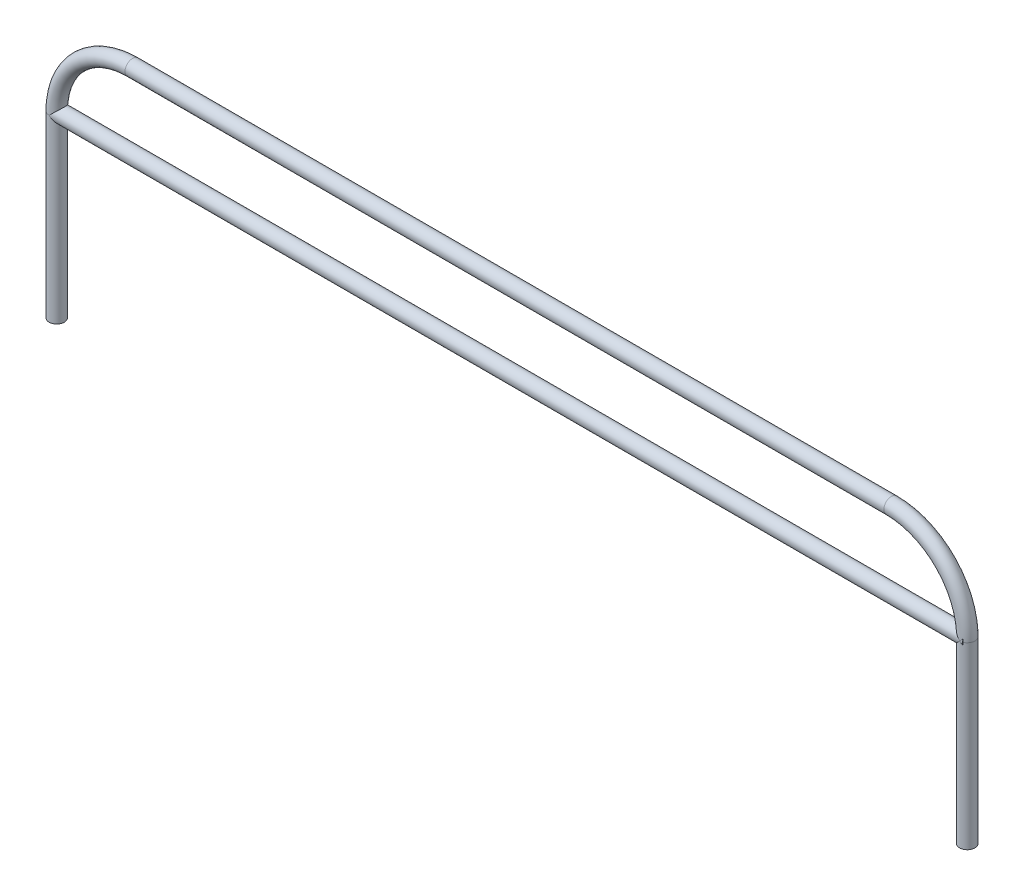
ISO-10303-21;
HEADER;
FILE_DESCRIPTION(('STEP AP214'),'2;1');
FILE_NAME('part.step','',(''),(''),'','','');
FILE_SCHEMA(('AUTOMOTIVE_DESIGN { 1 0 10303 214 1 1 1 1 }'));
ENDSEC;
DATA;
#1=APPLICATION_CONTEXT('core data for automotive mechanical design processes');
#2=APPLICATION_PROTOCOL_DEFINITION('international standard','automotive_design',2000,#1);
#3=PRODUCT_CONTEXT('',#1,'mechanical');
#4=PRODUCT('Part','Part','',(#3));
#5=PRODUCT_RELATED_PRODUCT_CATEGORY('part','',(#4));
#6=PRODUCT_DEFINITION_FORMATION('','',#4);
#7=PRODUCT_DEFINITION_CONTEXT('part definition',#1,'design');
#8=PRODUCT_DEFINITION('design','',#6,#7);
#9=PRODUCT_DEFINITION_SHAPE('','',#8);
#10=(LENGTH_UNIT() NAMED_UNIT(*) SI_UNIT(.MILLI.,.METRE.));
#11=(NAMED_UNIT(*) PLANE_ANGLE_UNIT() SI_UNIT($,.RADIAN.));
#12=(NAMED_UNIT(*) SI_UNIT($,.STERADIAN.) SOLID_ANGLE_UNIT());
#13=UNCERTAINTY_MEASURE_WITH_UNIT(LENGTH_MEASURE(1.E-05),#10,'distance_accuracy_value','');
#14=(GEOMETRIC_REPRESENTATION_CONTEXT(3) GLOBAL_UNCERTAINTY_ASSIGNED_CONTEXT((#13)) GLOBAL_UNIT_ASSIGNED_CONTEXT((#10,
#11,#12)) REPRESENTATION_CONTEXT('',''));
#15=CARTESIAN_POINT('',(0.,0.,0.));
#16=DIRECTION('',(0.,0.,1.));
#17=DIRECTION('',(1.,0.,0.));
#18=AXIS2_PLACEMENT_3D('',#15,#16,#17);
#19=CARTESIAN_POINT('',(1524.,300.,0.));
#20=DIRECTION('',(0.,-1.,0.));
#21=DIRECTION('',(0.,0.,-1.));
#22=AXIS2_PLACEMENT_3D('',#19,#20,#21);
#23=CYLINDRICAL_SURFACE('',#22,12.7);
#24=DIRECTION('',(0.,-1.,0.));
#25=VECTOR('',#24,1.);
#26=CARTESIAN_POINT('',(1528.8,300.,11.7579760163046));
#27=LINE('',#26,#25);
#28=CARTESIAN_POINT('',(1528.8,295.2,11.7579760163046));
#29=VERTEX_POINT('',#28);
#30=CARTESIAN_POINT('',(1528.8,300.,11.7579760163046));
#31=VERTEX_POINT('',#30);
#32=EDGE_CURVE('E56',#29,#31,#27,.F.);
#33=ORIENTED_EDGE('',*,*,#32,.F.);
#34=CARTESIAN_POINT('',(1524.,300.,0.));
#35=DIRECTION('',(-0.707106781186547,-0.707106781186547,0.));
#36=DIRECTION('',(0.707106781186547,-0.707106781186547,0.));
#37=AXIS2_PLACEMENT_3D('',#34,#35,#36);
#38=ELLIPSE('',#37,17.9605122421383,12.7);
#39=CARTESIAN_POINT('',(1524.,300.,12.7));
#40=VERTEX_POINT('',#39);
#41=EDGE_CURVE('E118',#29,#40,#38,.T.);
#42=ORIENTED_EDGE('',*,*,#41,.T.);
#43=CARTESIAN_POINT('',(1524.,300.,0.));
#44=DIRECTION('',(0.707106781186547,-0.707106781186547,0.));
#45=DIRECTION('',(-0.707106781186547,-0.707106781186547,0.));
#46=AXIS2_PLACEMENT_3D('',#43,#44,#45);
#47=ELLIPSE('',#46,17.9605122421383,12.7);
#48=CARTESIAN_POINT('',(1524.,300.,-12.7));
#49=VERTEX_POINT('',#48);
#50=EDGE_CURVE('E120',#40,#49,#47,.T.);
#51=ORIENTED_EDGE('',*,*,#50,.T.);
#52=CARTESIAN_POINT('',(1528.8,295.199999999999,-11.7579760163046));
#53=VERTEX_POINT('',#52);
#54=EDGE_CURVE('E117',#49,#53,#38,.T.);
#55=ORIENTED_EDGE('',*,*,#54,.T.);
#56=DIRECTION('',(0.,-1.,0.));
#57=VECTOR('',#56,1.);
#58=CARTESIAN_POINT('',(1528.8,300.,-11.7579760163046));
#59=LINE('',#58,#57);
#60=CARTESIAN_POINT('',(1528.8,300.,-11.7579760163046));
#61=VERTEX_POINT('',#60);
#62=EDGE_CURVE('E112',#61,#53,#59,.T.);
#63=ORIENTED_EDGE('',*,*,#62,.F.);
#64=CARTESIAN_POINT('',(1524.,300.,0.));
#65=DIRECTION('',(0.,-1.,0.));
#66=DIRECTION('',(0.,0.,1.));
#67=AXIS2_PLACEMENT_3D('',#64,#65,#66);
#68=CIRCLE('',#67,12.7);
#69=EDGE_CURVE('E102',#61,#31,#68,.T.);
#70=ORIENTED_EDGE('',*,*,#69,.T.);
#71=EDGE_LOOP('',(#33,#42,#51,#55,#63,#70));
#72=FACE_BOUND('',#71,.T.);
#73=CARTESIAN_POINT('',(1524.,0.,0.));
#74=DIRECTION('',(0.,-1.,0.));
#75=DIRECTION('',(0.,0.,1.));
#76=AXIS2_PLACEMENT_3D('',#73,#74,#75);
#77=CIRCLE('',#76,12.7);
#78=CARTESIAN_POINT('',(1524.,0.,12.7));
#79=VERTEX_POINT('',#78);
#80=EDGE_CURVE('E99',#79,#79,#77,.T.);
#81=ORIENTED_EDGE('',*,*,#80,.F.);
#82=EDGE_LOOP('',(#81));
#83=FACE_BOUND('',#82,.T.);
#84=ADVANCED_FACE('F32',(#72,#83),#23,.T.);
#85=CARTESIAN_POINT('',(1397.,300.,0.));
#86=DIRECTION('',(0.,0.,-1.));
#87=DIRECTION('',(-1.,0.,0.));
#88=AXIS2_PLACEMENT_3D('',#85,#86,#87);
#89=TOROIDAL_SURFACE('',#88,127.,12.7);
#90=CARTESIAN_POINT('',(1528.8,346.312525303635,0.));
#91=CARTESIAN_POINT('',(1528.8,346.312521618613,-0.132851835325493));
#92=CARTESIAN_POINT('',(1528.8,346.306212767445,-0.265744914230793));
#93=CARTESIAN_POINT('',(1528.8,346.281185925624,-0.530384735924056));
#94=CARTESIAN_POINT('',(1528.8,346.262460191122,-0.662130711335227));
#95=CARTESIAN_POINT('',(1528.8,346.188273127396,-1.05452133581633));
#96=CARTESIAN_POINT('',(1528.8,346.114804273676,-1.311910520727));
#97=CARTESIAN_POINT('',(1528.8,345.906680543614,-1.8659062132119));
#98=CARTESIAN_POINT('',(1528.8,345.762124307315,-2.15869230907699));
#99=CARTESIAN_POINT('',(1528.8,345.428066936224,-2.71719920169636));
#100=CARTESIAN_POINT('',(1528.8,345.238494839802,-2.98287630958142));
#101=CARTESIAN_POINT('',(1528.8,344.865045767263,-3.44122436436763));
#102=CARTESIAN_POINT('',(1528.8,344.686503900121,-3.63834720547557));
#103=CARTESIAN_POINT('',(1528.8,344.312934872909,-4.01644530542467));
#104=CARTESIAN_POINT('',(1528.8,344.117896418426,-4.19740932396886));
#105=CARTESIAN_POINT('',(1528.8,343.714858714513,-4.54497656025616));
#106=CARTESIAN_POINT('',(1528.8,343.506834594919,-4.7115506682785));
#107=CARTESIAN_POINT('',(1528.8,343.081006448831,-5.03148978639267));
#108=CARTESIAN_POINT('',(1528.8,342.863204590617,-5.18485770324727));
#109=CARTESIAN_POINT('',(1528.8,342.35747821265,-5.52136557905239));
#110=CARTESIAN_POINT('',(1528.8,342.067060122852,-5.70074732480982));
#111=CARTESIAN_POINT('',(1528.8,341.476535950189,-6.04290326600737));
#112=CARTESIAN_POINT('',(1528.8,341.176426013618,-6.20567074547378));
#113=CARTESIAN_POINT('',(1528.8,340.568334224242,-6.51690515716055));
#114=CARTESIAN_POINT('',(1528.8,340.260340920015,-6.66534959439288));
#115=CARTESIAN_POINT('',(1528.8,339.638573700211,-6.94940781951245));
#116=CARTESIAN_POINT('',(1528.8,339.324800542237,-7.08502327488086));
#117=CARTESIAN_POINT('',(1528.8,338.6910682318,-7.34555522159482));
#118=CARTESIAN_POINT('',(1528.8,338.371086325141,-7.47041612260878));
#119=CARTESIAN_POINT('',(1528.8,337.727336548413,-7.70994443382886));
#120=CARTESIAN_POINT('',(1528.8,337.403568587911,-7.82461159998408));
#121=CARTESIAN_POINT('',(1528.8,336.75326289647,-8.04469886554396));
#122=CARTESIAN_POINT('',(1528.8,336.426728138677,-8.1501277784411));
#123=CARTESIAN_POINT('',(1528.8,335.771128239009,-8.35275247979343));
#124=CARTESIAN_POINT('',(1528.8,335.442063115561,-8.44994832814438));
#125=CARTESIAN_POINT('',(1528.8,334.535730739436,-8.7065747856537));
#126=CARTESIAN_POINT('',(1528.8,333.956300040273,-8.85838740637715));
#127=CARTESIAN_POINT('',(1528.8,332.792691265036,-9.1427263159511));
#128=CARTESIAN_POINT('',(1528.8,332.208512495756,-9.27524973321925));
#129=CARTESIAN_POINT('',(1528.8,331.036326362809,-9.52373671017883));
#130=CARTESIAN_POINT('',(1528.8,330.448317067018,-9.6396911055486));
#131=CARTESIAN_POINT('',(1528.8,329.269678293818,-9.85713900503606));
#132=CARTESIAN_POINT('',(1528.8,328.679048942084,-9.95863319519915));
#133=CARTESIAN_POINT('',(1528.8,327.494343262537,-10.149209167039));
#134=CARTESIAN_POINT('',(1528.8,326.900262058561,-10.2382604585509));
#135=CARTESIAN_POINT('',(1528.8,325.710535380453,-10.4051925775368));
#136=CARTESIAN_POINT('',(1528.8,325.114889889919,-10.4830732873984));
#137=CARTESIAN_POINT('',(1528.8,323.922569021572,-10.628943175614));
#138=CARTESIAN_POINT('',(1528.8,323.325893989321,-10.6969351930294));
#139=CARTESIAN_POINT('',(1528.8,322.131606576365,-10.8241589853313));
#140=CARTESIAN_POINT('',(1528.8,321.533994178011,-10.8833905932253));
#141=CARTESIAN_POINT('',(1528.8,319.737544940157,-11.0496494757408));
#142=CARTESIAN_POINT('',(1528.8,318.537615866751,-11.1449412421124));
#143=CARTESIAN_POINT('',(1528.8,316.136022513097,-11.3104998614946));
#144=CARTESIAN_POINT('',(1528.8,314.934358138126,-11.3807652922334));
#145=CARTESIAN_POINT('',(1528.8,312.531605664065,-11.5007575571278));
#146=CARTESIAN_POINT('',(1528.8,311.330518886573,-11.5505112894763));
#147=CARTESIAN_POINT('',(1528.8,308.92779773747,-11.6329211830123));
#148=CARTESIAN_POINT('',(1528.8,307.726163377462,-11.6655776910666));
#149=CARTESIAN_POINT('',(1528.8,305.33970107351,-11.7156496642615));
#150=CARTESIAN_POINT('',(1528.8,304.154877445941,-11.7332755194715));
#151=CARTESIAN_POINT('',(1528.8,301.785103505995,-11.7552473466051));
#152=CARTESIAN_POINT('',(1528.8,300.600153192983,-11.7595932484257));
#153=CARTESIAN_POINT('',(1528.8,298.229743803538,-11.7552984378151));
#154=CARTESIAN_POINT('',(1528.8,297.04428473745,-11.7466518960742));
#155=CARTESIAN_POINT('',(1528.8,294.67354627955,-11.7157770435755));
#156=CARTESIAN_POINT('',(1528.8,293.48826688674,-11.6935488113261));
#157=CARTESIAN_POINT('',(1528.8,291.120580033978,-11.6340875769688));
#158=CARTESIAN_POINT('',(1528.8,289.938171792484,-11.5968863427833));
#159=CARTESIAN_POINT('',(1528.8,287.57399047528,-11.5050510527132));
#160=CARTESIAN_POINT('',(1528.8,286.392217414024,-11.4504166156426));
#161=CARTESIAN_POINT('',(1528.8,284.03026950217,-11.3202451909565));
#162=CARTESIAN_POINT('',(1528.8,282.850094206829,-11.2447164005573));
#163=CARTESIAN_POINT('',(1528.8,280.491673819762,-11.068027883674));
#164=CARTESIAN_POINT('',(1528.8,279.313428614266,-10.9668697269438));
#165=CARTESIAN_POINT('',(1528.8,277.546129847761,-10.790894420095));
#166=CARTESIAN_POINT('',(1528.8,276.955877923591,-10.7280482925473));
#167=CARTESIAN_POINT('',(1528.8,275.776416960041,-10.5932691470681));
#168=CARTESIAN_POINT('',(1528.8,275.187207899033,-10.5213363198776));
#169=CARTESIAN_POINT('',(1528.8,274.00991129661,-10.367203913118));
#170=CARTESIAN_POINT('',(1528.8,273.42182423598,-10.2850006423732));
#171=CARTESIAN_POINT('',(1528.8,272.247383675695,-10.1089882598372));
#172=CARTESIAN_POINT('',(1528.8,271.661030162978,-10.0151792357219));
#173=CARTESIAN_POINT('',(1528.8,270.49050813564,-9.81433740136345));
#174=CARTESIAN_POINT('',(1528.8,269.906339883578,-9.70730305154761));
#175=CARTESIAN_POINT('',(1528.8,268.740934919139,-9.47809037291378));
#176=CARTESIAN_POINT('',(1528.8,268.159698338768,-9.35591136839203));
#177=CARTESIAN_POINT('',(1528.8,267.001511328916,-9.09415788927796));
#178=CARTESIAN_POINT('',(1528.8,266.424558439716,-8.95459437363418));
#179=CARTESIAN_POINT('',(1528.8,265.275985249307,-8.6551451544851));
#180=CARTESIAN_POINT('',(1528.8,264.70436424851,-8.49526215849759));
#181=CARTESIAN_POINT('',(1528.8,263.565135338005,-8.15055124989955));
#182=CARTESIAN_POINT('',(1528.8,262.997568037583,-7.96558819354296));
#183=CARTESIAN_POINT('',(1528.8,261.87229238781,-7.56651451061898));
#184=CARTESIAN_POINT('',(1528.8,261.314588720592,-7.35239044018057));
#185=CARTESIAN_POINT('',(1528.8,260.48940914007,-7.00465500581044));
#186=CARTESIAN_POINT('',(1528.8,260.216306869127,-6.88434907492015));
#187=CARTESIAN_POINT('',(1528.8,259.674696727442,-6.63383563102363));
#188=CARTESIAN_POINT('',(1528.8,259.406188293442,-6.5036293427304));
#189=CARTESIAN_POINT('',(1528.8,258.875097119255,-6.23226570012393));
#190=CARTESIAN_POINT('',(1528.8,258.612508405795,-6.09112008710925));
#191=CARTESIAN_POINT('',(1528.8,258.094345026712,-5.79632356506714));
#192=CARTESIAN_POINT('',(1528.8,257.838771616139,-5.64267043767254));
#193=CARTESIAN_POINT('',(1528.8,257.334318156402,-5.31975154717188));
#194=CARTESIAN_POINT('',(1528.8,257.085520764114,-5.15035577536462));
#195=CARTESIAN_POINT('',(1528.8,256.599938371293,-4.79525695967531));
#196=CARTESIAN_POINT('',(1528.8,256.363147323385,-4.60956225661418));
#197=CARTESIAN_POINT('',(1528.8,255.906284484621,-4.22039793300787));
#198=CARTESIAN_POINT('',(1528.8,255.686143873167,-4.01700990520972));
#199=CARTESIAN_POINT('',(1528.8,255.267041696758,-3.58965581989469));
#200=CARTESIAN_POINT('',(1528.8,255.068054796045,-3.3657149916378));
#201=CARTESIAN_POINT('',(1528.8,254.708447578428,-2.90782043122897));
#202=CARTESIAN_POINT('',(1528.8,254.546342422672,-2.67504690629584));
#203=CARTESIAN_POINT('',(1528.8,254.256157153015,-2.18861149990642));
#204=CARTESIAN_POINT('',(1528.8,254.128071840942,-1.93495281743363));
#205=CARTESIAN_POINT('',(1528.8,253.96855453541,-1.53950420832056));
#206=CARTESIAN_POINT('',(1528.8,253.920616342753,-1.40427448264357));
#207=CARTESIAN_POINT('',(1528.8,253.837361057695,-1.13001084303668));
#208=CARTESIAN_POINT('',(1528.8,253.802037176576,-0.990979018811224));
#209=CARTESIAN_POINT('',(1528.8,253.745107179151,-0.710275873466651));
#210=CARTESIAN_POINT('',(1528.8,253.723486353805,-0.568607551178411));
#211=CARTESIAN_POINT('',(1528.8,253.694630372436,-0.283813730826364));
#212=CARTESIAN_POINT('',(1528.8,253.687393318785,-0.140688427484197));
#213=CARTESIAN_POINT('',(1528.8,253.687547712543,0.128523440438394));
#214=CARTESIAN_POINT('',(1528.8,253.693302479733,0.254612961991623));
#215=CARTESIAN_POINT('',(1528.8,253.715994612918,0.505795972329214));
#216=CARTESIAN_POINT('',(1528.8,253.732935512724,0.630889133710558));
#217=CARTESIAN_POINT('',(1528.8,253.799961604537,1.00328031534366));
#218=CARTESIAN_POINT('',(1528.8,253.866250734641,1.24778632579779));
#219=CARTESIAN_POINT('',(1528.8,254.057375692814,1.78317320452255));
#220=CARTESIAN_POINT('',(1528.8,254.192758742247,2.07020400838886));
#221=CARTESIAN_POINT('',(1528.8,254.507624185746,2.61898828441521));
#222=CARTESIAN_POINT('',(1528.8,254.687197673953,2.88068796635492));
#223=CARTESIAN_POINT('',(1528.8,255.041076131069,3.33142274964508));
#224=CARTESIAN_POINT('',(1528.8,255.209938678223,3.52483334691842));
#225=CARTESIAN_POINT('',(1528.8,255.563897222482,3.89631747611204));
#226=CARTESIAN_POINT('',(1528.8,255.749004041159,4.0743806249503));
#227=CARTESIAN_POINT('',(1528.8,256.132032463869,4.41675813412426));
#228=CARTESIAN_POINT('',(1528.8,256.329977315156,4.58104624370266));
#229=CARTESIAN_POINT('',(1528.8,256.735626335168,4.89693314903148));
#230=CARTESIAN_POINT('',(1528.8,256.943328761909,5.0485341964166));
#231=CARTESIAN_POINT('',(1528.8,257.374002230634,5.34558319876753));
#232=CARTESIAN_POINT('',(1528.8,257.597253519213,5.49062268472913));
#233=CARTESIAN_POINT('',(1528.8,258.050451568937,5.76989458142624));
#234=CARTESIAN_POINT('',(1528.8,258.280399837693,5.90412453272979));
#235=CARTESIAN_POINT('',(1528.8,258.745870393454,6.16298242705581));
#236=CARTESIAN_POINT('',(1528.8,258.981397215917,6.28760218024846));
#237=CARTESIAN_POINT('',(1528.8,259.456876548566,6.52810030180371));
#238=CARTESIAN_POINT('',(1528.8,259.696829366593,6.64397805926041));
#239=CARTESIAN_POINT('',(1528.8,260.180974919501,6.86809900749575));
#240=CARTESIAN_POINT('',(1528.8,260.425176582192,6.97632285065151));
#241=CARTESIAN_POINT('',(1528.8,260.916644827661,7.18555813046306));
#242=CARTESIAN_POINT('',(1528.8,261.163911448194,7.28656947817016));
#243=CARTESIAN_POINT('',(1528.8,261.660863603517,7.48195326727036));
#244=CARTESIAN_POINT('',(1528.8,261.910547470428,7.57632996017152));
#245=CARTESIAN_POINT('',(1528.8,262.412096342546,7.75906397599276));
#246=CARTESIAN_POINT('',(1528.8,262.663961325014,7.84742136158527));
#247=CARTESIAN_POINT('',(1528.8,263.470909519496,8.12066402653814));
#248=CARTESIAN_POINT('',(1528.8,264.02956127614,8.29506607481838));
#249=CARTESIAN_POINT('',(1528.8,265.153372780116,8.62162750438016));
#250=CARTESIAN_POINT('',(1528.8,265.718533972694,8.77378183930488));
#251=CARTESIAN_POINT('',(1528.8,266.854081205,9.05920263767372));
#252=CARTESIAN_POINT('',(1528.8,267.424471212045,9.1924532298542));
#253=CARTESIAN_POINT('',(1528.8,268.568777343651,9.44253523169981));
#254=CARTESIAN_POINT('',(1528.8,269.142693260965,9.55936759693782));
#255=CARTESIAN_POINT('',(1528.8,270.294957458085,9.77909121237066));
#256=CARTESIAN_POINT('',(1528.8,270.873313872529,9.88193954628393));
#257=CARTESIAN_POINT('',(1528.8,272.032135858961,10.0750716204355));
#258=CARTESIAN_POINT('',(1528.8,272.612601528142,10.1653547739427));
#259=CARTESIAN_POINT('',(1528.8,273.775209261784,10.3348614514237));
#260=CARTESIAN_POINT('',(1528.8,274.35735152349,10.4140836149095));
#261=CARTESIAN_POINT('',(1528.8,275.522887383735,10.5627301862627));
#262=CARTESIAN_POINT('',(1528.8,276.106281000393,10.6321544512736));
#263=CARTESIAN_POINT('',(1528.8,277.277303723902,10.7626595737081));
#264=CARTESIAN_POINT('',(1528.8,277.8649382528,10.8236915250493));
#265=CARTESIAN_POINT('',(1528.8,279.040904215353,10.9378996604337));
#266=CARTESIAN_POINT('',(1528.8,279.629235569974,10.9910766627236));
#267=CARTESIAN_POINT('',(1528.8,280.806559289901,11.0904164643289));
#268=CARTESIAN_POINT('',(1528.8,281.395551726741,11.136578411888));
#269=CARTESIAN_POINT('',(1528.8,282.574010217405,11.2225939736529));
#270=CARTESIAN_POINT('',(1528.8,283.163476284189,11.262447408875));
#271=CARTESIAN_POINT('',(1528.8,284.930307145895,11.3733668049911));
#272=CARTESIAN_POINT('',(1528.8,286.108207394764,11.4359644991802));
#273=CARTESIAN_POINT('',(1528.8,288.464783110447,11.5425379669578));
#274=CARTESIAN_POINT('',(1528.8,289.643458549181,11.5865143814679));
#275=CARTESIAN_POINT('',(1528.8,291.584029962439,11.6458789835511));
#276=CARTESIAN_POINT('',(1528.8,292.345789542371,11.6658766412813));
#277=CARTESIAN_POINT('',(1528.8,293.869443198689,11.6997967766044));
#278=CARTESIAN_POINT('',(1528.8,294.631337274926,11.713719260828));
#279=CARTESIAN_POINT('',(1528.8,296.155445036084,11.735879532303));
#280=CARTESIAN_POINT('',(1528.8,296.917658746495,11.7441155423716));
#281=CARTESIAN_POINT('',(1528.8,298.442126410918,11.7551235477537));
#282=CARTESIAN_POINT('',(1528.8,299.204380364984,11.7578955354924));
#283=CARTESIAN_POINT('',(1528.8,300.726281848038,11.7580527796108));
#284=CARTESIAN_POINT('',(1528.8,301.485929375227,11.7554564264886));
#285=CARTESIAN_POINT('',(1528.8,303.00518466221,11.7448418355784));
#286=CARTESIAN_POINT('',(1528.8,303.764792422111,11.7368236132706));
#287=CARTESIAN_POINT('',(1528.8,305.283855328744,11.7151458356132));
#288=CARTESIAN_POINT('',(1528.8,306.043310483127,11.7014868233278));
#289=CARTESIAN_POINT('',(1528.8,307.562088549556,11.6681514629778));
#290=CARTESIAN_POINT('',(1528.8,308.321411461657,11.6484751173858));
#291=CARTESIAN_POINT('',(1528.8,310.117181255613,11.5942002027298));
#292=CARTESIAN_POINT('',(1528.8,311.153545176774,11.5567762587774));
#293=CARTESIAN_POINT('',(1528.8,313.225665185334,11.4678882171768));
#294=CARTESIAN_POINT('',(1528.8,314.261421281197,11.4164243199355));
#295=CARTESIAN_POINT('',(1528.8,316.332627625613,11.2969008992401));
#296=CARTESIAN_POINT('',(1528.8,317.368077294566,11.2288311915109));
#297=CARTESIAN_POINT('',(1528.8,319.437477300825,11.0728414209058));
#298=CARTESIAN_POINT('',(1528.8,320.471427689327,10.98492205272));
#299=CARTESIAN_POINT('',(1528.8,322.215013670433,10.816148372481));
#300=CARTESIAN_POINT('',(1528.8,322.925262510127,10.7416368765602));
#301=CARTESIAN_POINT('',(1528.8,324.344252267267,10.5794737573678));
#302=CARTESIAN_POINT('',(1528.8,325.052993226236,10.4918225007961));
#303=CARTESIAN_POINT('',(1528.8,326.468536060226,10.301323344298));
#304=CARTESIAN_POINT('',(1528.8,327.175337682186,10.1984735490121));
#305=CARTESIAN_POINT('',(1528.8,328.586147061796,9.97510445018053));
#306=CARTESIAN_POINT('',(1528.8,329.290154897444,9.85458564354033));
#307=CARTESIAN_POINT('',(1528.8,330.677448651454,9.59596995547017));
#308=CARTESIAN_POINT('',(1528.8,331.360825571346,9.45836582078071));
#309=CARTESIAN_POINT('',(1528.8,332.722592527563,9.15984156140646));
#310=CARTESIAN_POINT('',(1528.8,333.400981943996,8.9989185882575));
#311=CARTESIAN_POINT('',(1528.8,334.750870308653,8.64918418061706));
#312=CARTESIAN_POINT('',(1528.8,335.422367205773,8.46036468797358));
#313=CARTESIAN_POINT('',(1528.8,336.421680355729,8.15177495545794));
#314=CARTESIAN_POINT('',(1528.8,336.753430633343,8.04469667997318));
#315=CARTESIAN_POINT('',(1528.8,337.413731391927,7.82111664013643));
#316=CARTESIAN_POINT('',(1528.8,337.742282061604,7.70461543534885));
#317=CARTESIAN_POINT('',(1528.8,338.467036982558,7.43441559400043));
#318=CARTESIAN_POINT('',(1528.8,338.86229506525,7.27815908398861));
#319=CARTESIAN_POINT('',(1528.8,339.645166788696,6.94762137236131));
#320=CARTESIAN_POINT('',(1528.8,340.032781933414,6.77334375991943));
#321=CARTESIAN_POINT('',(1528.8,340.797402766981,6.40394812827175));
#322=CARTESIAN_POINT('',(1528.8,341.174421493978,6.20885727651431));
#323=CARTESIAN_POINT('',(1528.8,341.914540266165,5.7939057711562));
#324=CARTESIAN_POINT('',(1528.8,342.277647812874,5.57405872650105));
#325=CARTESIAN_POINT('',(1528.8,342.821626199614,5.21274337266058));
#326=CARTESIAN_POINT('',(1528.8,343.009473633545,5.08175576503509));
#327=CARTESIAN_POINT('',(1528.8,343.378119639761,4.8102442902997));
#328=CARTESIAN_POINT('',(1528.8,343.55891985993,4.66972267389306));
#329=CARTESIAN_POINT('',(1528.8,343.911842009585,4.37815716062576));
#330=CARTESIAN_POINT('',(1528.8,344.083965336546,4.22711496757186));
#331=CARTESIAN_POINT('',(1528.8,344.417319615102,3.91352449942312));
#332=CARTESIAN_POINT('',(1528.8,344.57855360689,3.75097946197601));
#333=CARTESIAN_POINT('',(1528.8,344.962502798594,3.33127131690539));
#334=CARTESIAN_POINT('',(1528.8,345.177081484379,3.06647212794203));
#335=CARTESIAN_POINT('',(1528.8,345.563482712528,2.50714764972497));
#336=CARTESIAN_POINT('',(1528.8,345.735373942527,2.21267120138394));
#337=CARTESIAN_POINT('',(1528.8,345.985046782825,1.67132473192174));
#338=CARTESIAN_POINT('',(1528.8,346.075565800775,1.43045072435182));
#339=CARTESIAN_POINT('',(1528.8,346.180331541667,1.06078379729255));
#340=CARTESIAN_POINT('',(1528.8,346.210072177089,0.936281223666805));
#341=CARTESIAN_POINT('',(1528.8,346.258585226147,0.685181593095771));
#342=CARTESIAN_POINT('',(1528.8,346.277363984532,0.55858579143814));
#343=CARTESIAN_POINT('',(1528.8,346.29776080048,0.359776343955257));
#344=CARTESIAN_POINT('',(1528.8,346.303291514417,0.287943243491947));
#345=CARTESIAN_POINT('',(1528.8,346.310675056624,0.144077491577746));
#346=CARTESIAN_POINT('',(1528.8,346.312527302002,0.0720448103118436));
#347=CARTESIAN_POINT('',(1528.8,346.312525303635,0.));
#348=B_SPLINE_CURVE_WITH_KNOTS('',3,(#90,#91,#92,#93,#94,#95,#96,#97,#98,#99,#100,#101,#102,
#103,#104,#105,#106,#107,#108,#109,#110,#111,#112,#113,#114,#115,#116,#117,#118,#119,#120,#121,
#122,#123,#124,#125,#126,#127,#128,#129,#130,#131,#132,#133,#134,#135,#136,#137,#138,#139,#140,
#141,#142,#143,#144,#145,#146,#147,#148,#149,#150,#151,#152,#153,#154,#155,#156,#157,#158,#159,
#160,#161,#162,#163,#164,#165,#166,#167,#168,#169,#170,#171,#172,#173,#174,#175,#176,#177,#178,
#179,#180,#181,#182,#183,#184,#185,#186,#187,#188,#189,#190,#191,#192,#193,#194,#195,#196,#197,
#198,#199,#200,#201,#202,#203,#204,#205,#206,#207,#208,#209,#210,#211,#212,#213,#214,#215,#216,
#217,#218,#219,#220,#221,#222,#223,#224,#225,#226,#227,#228,#229,#230,#231,#232,#233,#234,#235,
#236,#237,#238,#239,#240,#241,#242,#243,#244,#245,#246,#247,#248,#249,#250,#251,#252,#253,#254,
#255,#256,#257,#258,#259,#260,#261,#262,#263,#264,#265,#266,#267,#268,#269,#270,#271,#272,#273,
#274,#275,#276,#277,#278,#279,#280,#281,#282,#283,#284,#285,#286,#287,#288,#289,#290,#291,#292,
#293,#294,#295,#296,#297,#298,#299,#300,#301,#302,#303,#304,#305,#306,#307,#308,#309,#310,#311,
#312,#313,#314,#315,#316,#317,#318,#319,#320,#321,#322,#323,#324,#325,#326,#327,#328,#329,#330,
#331,#332,#333,#334,#335,#336,#337,#338,#339,#340,#341,#342,#343,#344,#345,#346,#347),
.UNSPECIFIED.,.T.,.F.,(4,2,2,2,2,2,2,2,2,2,2,2,2,2,2,2,2,2,2,2,2,2,2,2,2,2,2,2,2,2,2,2,2,2,2,2,
2,2,2,2,2,2,2,2,2,2,2,2,2,2,2,2,2,2,2,2,2,2,2,2,2,2,2,2,2,2,2,2,2,2,2,2,2,2,2,2,2,2,2,2,2,2,2,2,
2,2,2,2,2,2,2,2,2,2,2,2,2,2,2,2,2,2,2,2,2,2,2,2,2,2,2,2,2,2,2,2,2,2,2,2,2,2,2,2,2,2,2,2,4),(0.,
0.398468325684877,0.797185392071593,1.59582509086649,2.57006392665944,3.54584883903073,
4.34262542942247,5.13995201960913,5.93885551225934,6.73758270950694,7.76095133963922,
8.78473202065486,9.81009528049014,10.8353250823497,11.8655707769502,12.8958411302966,
13.9251176318595,14.9543866447646,16.7509189602903,18.5477184525093,20.3455079388596,
22.1432121030328,23.9452468910339,25.7473006508227,27.5488360120522,29.3504057100406,
32.9611552031154,36.5721098659763,40.1783140933498,43.7844451555466,47.3392300451113,
50.8940336998624,54.4504327619591,58.0068112666333,61.5556837173573,65.1046337713225,
68.6521934804721,72.1995359602831,73.9802439008727,75.7609144684143,77.542226856126,
79.3235257877126,81.1050322777068,82.8866182811815,84.6670868285404,86.4473183813566,
88.2375550756905,90.0286199203538,90.9237400395273,91.8187496084225,92.7128115139913,
93.6070323398039,94.5094364953006,95.4113815169742,96.3093678304846,97.2062662140658,
98.0550870867302,98.9037781863501,99.3336964558647,99.7633830037953,100.192607535878,
100.621775437316,100.999926473868,101.378197029303,102.134453321388,103.081378843779,
104.030272953909,104.799468378334,105.569180171084,106.340326938173,107.111336554563,
107.90967045353,108.70818548267,109.50737365563,110.306617625621,111.107814615379,
111.90902148426,112.709710166813,113.510390511399,115.265486402286,117.020979778795,
118.777938424145,120.534794768679,122.296926654995,124.059140796479,125.821571497523,
127.584027892713,129.35635517507,131.128497704478,132.900855232869,134.673263037153,
138.21175019536,141.750115553279,144.036158543587,146.322199038862,148.608953663012,
150.895711457346,153.174648412672,155.453578861423,157.732289958477,160.011000119174,
163.122034383951,166.233024244049,169.34592687931,172.458720587372,174.601059508574,
176.743338653241,178.885885180252,181.028371463988,183.119304771246,185.210493707754,
187.302287887679,188.347980360421,189.393610782045,190.668298484135,191.942732800198,
193.215523496566,194.487617900464,195.174391953237,195.861004438905,196.547505985111,
197.233815067866,198.253190996702,199.270915880129,200.039470467069,200.423078191029,
200.80646366159,201.022516582009,201.238603735558),.UNSPECIFIED.);
#349=CARTESIAN_POINT('',(1528.79999999999,304.890708661404,-11.7205361988806));
#350=VERTEX_POINT('',#349);
#351=EDGE_CURVE('E11',#350,#61,#348,.T.);
#352=ORIENTED_EDGE('',*,*,#351,.F.);
#353=CARTESIAN_POINT('',(1528.8002,304.89091622063,-11.7204495870583));
#354=CARTESIAN_POINT('',(1528.60746936918,304.69090040269,-11.8039088431735));
#355=CARTESIAN_POINT('',(1528.41338267963,304.489917271006,-11.8817742394908));
#356=CARTESIAN_POINT('',(1528.02280980899,304.086372350868,-12.0265351176167));
#357=CARTESIAN_POINT('',(1527.82632384369,303.88381070496,-12.0934315782094));
#358=CARTESIAN_POINT('',(1527.2337135355,303.274268497641,-12.278005789881));
#359=CARTESIAN_POINT('',(1526.83440775169,302.865400531232,-12.3795808352824));
#360=CARTESIAN_POINT('',(1526.03386724269,302.049528179285,-12.5403608130649));
#361=CARTESIAN_POINT('',(1525.6326907563,301.642545421451,-12.5999752801295));
#362=CARTESIAN_POINT('',(1524.8266023989,300.828653486874,-12.6795258236633));
#363=CARTESIAN_POINT('',(1524.42169240075,300.42174436762,-12.6994808113262));
#364=CARTESIAN_POINT('',(1524.01062472908,300.010625061749,-12.6999966656548));
#365=CARTESIAN_POINT('',(1524.00531243575,300.005312435075,-12.6999999989256));
#366=CARTESIAN_POINT('',(1524.,300.,-12.7));
#367=B_SPLINE_CURVE_WITH_KNOTS('',3,(#353,#354,#355,#356,#357,#358,#359,#360,#361,#362,#363,
#364,#365,#366),.UNSPECIFIED.,.F.,.F.,(4,2,2,2,2,2,4),(0.,0.869953299742271,1.7398289291795,
3.47944955797588,5.20184682465471,6.92342258758875,6.94596144515744),.UNSPECIFIED.);
#368=EDGE_CURVE('E95',#350,#49,#367,.T.);
#369=ORIENTED_EDGE('',*,*,#368,.T.);
#370=CARTESIAN_POINT('',(1524.,300.,-12.7));
#371=CARTESIAN_POINT('',(1523.99468756792,300.005312433041,-12.6999999980056));
#372=CARTESIAN_POINT('',(1523.98937494128,300.010624726327,-12.6999966647531));
#373=CARTESIAN_POINT('',(1523.48404706667,300.515889094957,-12.6993628071729));
#374=CARTESIAN_POINT('',(1522.98233022296,301.014581782025,-12.6692320300438));
#375=CARTESIAN_POINT('',(1521.97912322671,302.005790034514,-12.550548985373));
#376=CARTESIAN_POINT('',(1521.47763361386,302.49830009041,-12.4619479242095));
#377=CARTESIAN_POINT('',(1520.4775017124,303.474634686442,-12.2257828662982));
#378=CARTESIAN_POINT('',(1519.97886959749,303.958434599018,-12.0780728796392));
#379=CARTESIAN_POINT('',(1518.99005476234,304.91208921697,-11.7226373466386));
#380=CARTESIAN_POINT('',(1518.49986767358,305.38195122899,-11.5149438811454));
#381=CARTESIAN_POINT('',(1517.66966126005,306.173044420828,-11.1050400500018));
#382=CARTESIAN_POINT('',(1517.32638889141,306.498720398783,-10.9178994576933));
#383=CARTESIAN_POINT('',(1516.6489144822,307.138787023944,-10.5105487198163));
#384=CARTESIAN_POINT('',(1516.3147126137,307.453177457097,-10.2903379474193));
#385=CARTESIAN_POINT('',(1515.65891165919,308.067598430298,-9.81601717705304));
#386=CARTESIAN_POINT('',(1515.33728800345,308.36765724808,-9.56197802724488));
#387=CARTESIAN_POINT('',(1514.70949428258,308.951076162452,-9.01815849267549));
#388=CARTESIAN_POINT('',(1514.40331866055,309.234442269914,-8.72839109098929));
#389=CARTESIAN_POINT('',(1513.89954464611,309.698975056733,-8.20385373160621));
#390=CARTESIAN_POINT('',(1513.69686241291,309.88535862077,-7.97855827623083));
#391=CARTESIAN_POINT('',(1513.30318147367,310.246490884857,-7.50913475676501));
#392=CARTESIAN_POINT('',(1513.11218225993,310.421240090521,-7.26500751207779));
#393=CARTESIAN_POINT('',(1512.74429927388,310.757051190613,-6.75783023513397));
#394=CARTESIAN_POINT('',(1512.56740301152,310.918125204645,-6.49479734798847));
#395=CARTESIAN_POINT('',(1512.23021842414,311.224508534818,-5.9496299641366));
#396=CARTESIAN_POINT('',(1512.06992400968,311.369823632148,-5.66750253440909));
#397=CARTESIAN_POINT('',(1511.80252245687,311.611789494298,-5.14964153747191));
#398=CARTESIAN_POINT('',(1511.6915282916,311.712063865385,-4.91760269932725));
#399=CARTESIAN_POINT('',(1511.48294794549,311.900257869777,-4.44286001994804));
#400=CARTESIAN_POINT('',(1511.3853542515,311.988184426683,-4.20016225636255));
#401=CARTESIAN_POINT('',(1511.20513721081,312.150373079338,-3.70490204107863));
#402=CARTESIAN_POINT('',(1511.1225091232,312.224639502553,-3.45234274431077));
#403=CARTESIAN_POINT('',(1510.97375947583,312.35821925965,-2.93851440302235));
#404=CARTESIAN_POINT('',(1510.90763805139,312.417532470943,-2.67724528711662));
#405=CARTESIAN_POINT('',(1510.79285529891,312.520430774073,-2.1454089807939));
#406=CARTESIAN_POINT('',(1510.74434769418,312.563877409519,-1.87478149380497));
#407=CARTESIAN_POINT('',(1510.66678363258,312.633322095785,-1.32851947398152));
#408=CARTESIAN_POINT('',(1510.63772712325,312.659320193653,-1.0528849546501));
#409=CARTESIAN_POINT('',(1510.59984451266,312.693211375265,-0.499256491568665));
#410=CARTESIAN_POINT('',(1510.59100797123,312.701113802336,-0.221263839850033));
#411=CARTESIAN_POINT('',(1510.59378085739,312.698633687683,0.334522159946045));
#412=CARTESIAN_POINT('',(1510.60538831327,312.688252909262,0.612315524658594));
#413=CARTESIAN_POINT('',(1510.6459293112,312.65198065714,1.12947059185015));
#414=CARTESIAN_POINT('',(1510.67244334318,312.628255009218,1.36918142652874));
#415=CARTESIAN_POINT('',(1510.74020430187,312.567586902337,1.84478036081206));
#416=CARTESIAN_POINT('',(1510.78144935786,312.530646121601,2.08066894184031));
#417=CARTESIAN_POINT('',(1510.87791433917,312.444184825505,2.54727003514235));
#418=CARTESIAN_POINT('',(1510.93313783088,312.394661099791,2.77798121010338));
#419=CARTESIAN_POINT('',(1511.05661254547,312.283830481585,3.23301315678454));
#420=CARTESIAN_POINT('',(1511.12486634748,312.222521256345,3.45733265326638));
#421=CARTESIAN_POINT('',(1511.29516099078,312.069391308483,3.96341846335716));
#422=CARTESIAN_POINT('',(1511.40123889655,311.973896684787,4.24272326781597));
#423=CARTESIAN_POINT('',(1511.63110695072,311.766624094134,4.78765176194547));
#424=CARTESIAN_POINT('',(1511.7549014661,311.654842112363,5.05327205648602));
#425=CARTESIAN_POINT('',(1512.01809218791,311.416755106671,5.57035265053736));
#426=CARTESIAN_POINT('',(1512.15750954866,311.290430384464,5.82179304024548));
#427=CARTESIAN_POINT('',(1512.44969089218,311.025158404588,6.3097566134948));
#428=CARTESIAN_POINT('',(1512.60245567048,310.886210394521,6.54627890643277));
#429=CARTESIAN_POINT('',(1512.9830191834,310.539324678108,7.09623682137432));
#430=CARTESIAN_POINT('',(1513.21635001487,310.326057743926,7.40250116918278));
#431=CARTESIAN_POINT('',(1513.7011318389,309.88151439576,7.98626188322028));
#432=CARTESIAN_POINT('',(1513.95258982251,309.650231030622,8.26374704854786));
#433=CARTESIAN_POINT('',(1514.4704374582,309.172297080939,8.79123567729414));
#434=CARTESIAN_POINT('',(1514.73685103065,308.925621803584,9.04119310545833));
#435=CARTESIAN_POINT('',(1515.28130177305,308.419715887621,9.51410965088371));
#436=CARTESIAN_POINT('',(1515.55933880581,308.160485397197,9.737069086686));
#437=CARTESIAN_POINT('',(1516.24163284881,307.522017334163,10.2438880636757));
#438=CARTESIAN_POINT('',(1516.65055588093,307.137468399055,10.51482371843));
#439=CARTESIAN_POINT('',(1517.48184997794,306.351562421405,11.0073984618948));
#440=CARTESIAN_POINT('',(1517.90422716803,305.950197696219,11.2290147196377));
#441=CARTESIAN_POINT('',(1518.75819275331,305.134349465064,11.624711765412));
#442=CARTESIAN_POINT('',(1519.18977913353,304.719868819474,11.7988028393004));
#443=CARTESIAN_POINT('',(1520.05880951627,303.880780324846,12.1007543604672));
#444=CARTESIAN_POINT('',(1520.49625125003,303.456176351151,12.2286322052166));
#445=CARTESIAN_POINT('',(1521.44197973465,302.533268843115,12.455191960012));
#446=CARTESIAN_POINT('',(1521.95081192945,302.033676837147,12.5463553438518));
#447=CARTESIAN_POINT('',(1522.9683670079,301.02846025401,12.6683887058304));
#448=CARTESIAN_POINT('',(1523.47708878477,300.522846502373,12.699354089461));
#449=CARTESIAN_POINT('',(1523.98937494116,300.010624726447,12.699996664644));
#450=CARTESIAN_POINT('',(1523.99468756779,300.005312433166,12.6999999978947));
#451=CARTESIAN_POINT('',(1524.,300.,12.7));
#452=B_SPLINE_CURVE_WITH_KNOTS('',3,(#370,#371,#372,#373,#374,#375,#376,#377,#378,#379,#380,
#381,#382,#383,#384,#385,#386,#387,#388,#389,#390,#391,#392,#393,#394,#395,#396,#397,#398,#399,
#400,#401,#402,#403,#404,#405,#406,#407,#408,#409,#410,#411,#412,#413,#414,#415,#416,#417,#418,
#419,#420,#421,#422,#423,#424,#425,#426,#427,#428,#429,#430,#431,#432,#433,#434,#435,#436,#437,
#438,#439,#440,#441,#442,#443,#444,#445,#446,#447,#448,#449,#450,#451),.UNSPECIFIED.,.F.,.F.,(4,
2,2,2,2,2,2,2,2,2,2,2,2,2,2,2,2,2,2,2,2,2,2,2,2,2,2,2,2,2,2,2,2,2,2,2,2,2,2,2,4),(0.,
0.0225388575683376,2.14377969478487,4.2667929558989,6.39508241820121,8.52223571279822,
10.0476413845192,11.5730759731767,13.0953646048827,14.6171016825996,15.6836690525037,
16.7501900403946,17.8157557392544,18.88092920139,19.7084263004517,20.535457541125,
21.3622263292583,22.1890018952089,23.0228288614888,23.8566535794137,24.6900476719563,
25.5233613932292,26.2495351041499,26.9756166291421,27.7018835895983,28.4282944510432,
29.3678948024224,30.3077271572145,31.2488478440679,32.1900246622988,33.508450572417,
34.8273877053521,36.1484980651933,37.4695928361366,39.3367888051928,41.2048473481095,
43.0725012667322,44.9394513525645,47.0936285976453,49.2443889779129,49.2669278354814),.UNSPECIFIED.);
#453=EDGE_CURVE('E48',#49,#40,#452,.T.);
#454=ORIENTED_EDGE('',*,*,#453,.T.);
#455=CARTESIAN_POINT('',(1524.,300.,12.7));
#456=CARTESIAN_POINT('',(1524.00531243575,300.005312435075,12.6999999989256));
#457=CARTESIAN_POINT('',(1524.01062472908,300.01062506175,12.6999966656548));
#458=CARTESIAN_POINT('',(1524.42169240074,300.421744367629,12.6994808113262));
#459=CARTESIAN_POINT('',(1524.8266023989,300.828653486877,12.6795258236633));
#460=CARTESIAN_POINT('',(1525.6326907563,301.642545421449,12.5999752801295));
#461=CARTESIAN_POINT('',(1526.03386724269,302.049528179284,12.5403608130648));
#462=CARTESIAN_POINT('',(1526.83440775169,302.865400531232,12.3795808352824));
#463=CARTESIAN_POINT('',(1527.2337135355,303.274268497641,12.278005789881));
#464=CARTESIAN_POINT('',(1527.82632384369,303.883810704959,12.0934315782095));
#465=CARTESIAN_POINT('',(1528.02280980899,304.086372350868,12.0265351176167));
#466=CARTESIAN_POINT('',(1528.41338267963,304.489917271006,11.8817742394909));
#467=CARTESIAN_POINT('',(1528.60746936918,304.69090040269,11.8039088431736));
#468=CARTESIAN_POINT('',(1528.8002,304.890916220631,11.7204495870583));
#469=B_SPLINE_CURVE_WITH_KNOTS('',3,(#455,#456,#457,#458,#459,#460,#461,#462,#463,#464,#465,
#466,#467,#468),.UNSPECIFIED.,.F.,.F.,(4,2,2,2,2,2,4),(0.,0.0225388575688521,1.74411462050297,
3.4665118871818,5.20613251597738,6.07600814541485,6.94596144515747),.UNSPECIFIED.);
#470=CARTESIAN_POINT('',(1528.8,304.890708661435,11.7205361988676));
#471=VERTEX_POINT('',#470);
#472=EDGE_CURVE('E122',#40,#471,#469,.T.);
#473=ORIENTED_EDGE('',*,*,#472,.T.);
#474=EDGE_CURVE('E35',#31,#471,#348,.T.);
#475=ORIENTED_EDGE('',*,*,#474,.F.);
#476=ORIENTED_EDGE('',*,*,#69,.F.);
#477=EDGE_LOOP('',(#352,#369,#454,#473,#475,#476));
#478=FACE_BOUND('',#477,.T.);
#479=CARTESIAN_POINT('',(1397.,427.,0.));
#480=DIRECTION('',(1.,0.,0.));
#481=DIRECTION('',(0.,0.,1.));
#482=AXIS2_PLACEMENT_3D('',#479,#480,#481);
#483=CIRCLE('',#482,12.7);
#484=CARTESIAN_POINT('',(1397.,427.,12.7));
#485=VERTEX_POINT('',#484);
#486=EDGE_CURVE('E106',#485,#485,#483,.T.);
#487=ORIENTED_EDGE('',*,*,#486,.T.);
#488=EDGE_LOOP('',(#487));
#489=FACE_BOUND('',#488,.T.);
#490=ADVANCED_FACE('F132',(#478,#489),#89,.T.);
#491=CARTESIAN_POINT('',(127.,300.,0.));
#492=DIRECTION('',(0.,0.,-1.));
#493=DIRECTION('',(-1.,0.,0.));
#494=AXIS2_PLACEMENT_3D('',#491,#492,#493);
#495=TOROIDAL_SURFACE('',#494,127.,12.7);
#496=CARTESIAN_POINT('',(127.,427.,0.));
#497=DIRECTION('',(1.,0.,0.));
#498=DIRECTION('',(0.,0.,1.));
#499=AXIS2_PLACEMENT_3D('',#496,#497,#498);
#500=CIRCLE('',#499,12.7);
#501=CARTESIAN_POINT('',(127.,427.,12.7));
#502=VERTEX_POINT('',#501);
#503=EDGE_CURVE('E89',#502,#502,#500,.T.);
#504=ORIENTED_EDGE('',*,*,#503,.F.);
#505=EDGE_LOOP('',(#504));
#506=FACE_BOUND('',#505,.T.);
#507=CARTESIAN_POINT('',(0.,300.,0.));
#508=DIRECTION('',(0.,1.,0.));
#509=DIRECTION('',(0.,0.,1.));
#510=AXIS2_PLACEMENT_3D('',#507,#508,#509);
#511=CIRCLE('',#510,12.7);
#512=CARTESIAN_POINT('',(0.,300.,-12.7));
#513=VERTEX_POINT('',#512);
#514=CARTESIAN_POINT('',(0.,300.,12.7));
#515=VERTEX_POINT('',#514);
#516=EDGE_CURVE('E82',#513,#515,#511,.T.);
#517=ORIENTED_EDGE('',*,*,#516,.T.);
#518=CARTESIAN_POINT('',(0.,300.,12.7000000000002));
#519=CARTESIAN_POINT('',(0.00531243208214947,300.005312433041,12.6999999980057));
#520=CARTESIAN_POINT('',(0.0106250587203238,300.010624726327,12.6999966647532));
#521=CARTESIAN_POINT('',(0.515952933345472,300.515889094928,12.6993628071677));
#522=CARTESIAN_POINT('',(1.01766977703102,301.014581782007,12.6692320300432));
#523=CARTESIAN_POINT('',(2.02087677325768,302.005790034495,12.550548985378));
#524=CARTESIAN_POINT('',(2.52236638610588,302.498300090381,12.4619479242157));
#525=CARTESIAN_POINT('',(3.5224982875578,303.474634686397,12.2257828663099));
#526=CARTESIAN_POINT('',(4.02113040245868,303.958434598967,12.0780728796552));
#527=CARTESIAN_POINT('',(5.00994523758981,304.912089216908,11.7226373466644));
#528=CARTESIAN_POINT('',(5.50013232634832,305.381951228923,11.5149438811767));
#529=CARTESIAN_POINT('',(6.33033873987546,306.173044420759,11.1050400500402));
#530=CARTESIAN_POINT('',(6.67361110852554,306.498720398718,10.9178994577321));
#531=CARTESIAN_POINT('',(7.35108551774249,307.138787023886,10.5105487198554));
#532=CARTESIAN_POINT('',(7.68528738624084,307.453177457044,10.2903379474582));
#533=CARTESIAN_POINT('',(8.34108834075915,308.067598430252,9.81601717709087));
#534=CARTESIAN_POINT('',(8.66271199650114,308.367657248038,9.56197802728176));
#535=CARTESIAN_POINT('',(9.29050571737802,308.951076162418,9.01815849270979));
#536=CARTESIAN_POINT('',(9.59668133942017,309.234442269884,8.72839109102193));
#537=CARTESIAN_POINT('',(10.1004553538607,309.698975056707,8.2038537316374));
#538=CARTESIAN_POINT('',(10.3031375870639,309.885358620745,7.97855827626258));
#539=CARTESIAN_POINT('',(10.6968185263068,310.246490884833,7.50913475679783));
#540=CARTESIAN_POINT('',(10.887817740047,310.421240090498,7.26500751211111));
#541=CARTESIAN_POINT('',(11.2557007260981,310.757051190591,6.75783023516836));
#542=CARTESIAN_POINT('',(11.4325969884553,310.918125204624,6.49479734802342));
#543=CARTESIAN_POINT('',(11.769781575835,311.224508534799,5.94962996417261));
#544=CARTESIAN_POINT('',(11.930075990301,311.36982363213,5.66750253444558));
#545=CARTESIAN_POINT('',(12.1974775431162,311.611789494281,5.14964153750882));
#546=CARTESIAN_POINT('',(12.3084717083835,311.71206386537,4.91760269936407));
#547=CARTESIAN_POINT('',(12.5170520544942,311.900257869764,4.44286001998464));
#548=CARTESIAN_POINT('',(12.6146457484904,311.98818442667,4.20016225639901));
#549=CARTESIAN_POINT('',(12.7948627891822,312.150373079327,3.70490204111468));
#550=CARTESIAN_POINT('',(12.8774908767839,312.224639502543,3.45234274434653));
#551=CARTESIAN_POINT('',(13.026240524157,312.358219259642,2.93851440305745));
#552=CARTESIAN_POINT('',(13.092361948603,312.417532470935,2.67724528715133));
#553=CARTESIAN_POINT('',(13.2071447010801,312.520430774067,2.14540898082769));
#554=CARTESIAN_POINT('',(13.2556523058103,312.563877409514,1.87478149383822));
#555=CARTESIAN_POINT('',(13.3332163674191,312.633322095782,1.32851947401356));
#556=CARTESIAN_POINT('',(13.3622728767461,312.659320193651,1.05288495468149));
#557=CARTESIAN_POINT('',(13.4001554873393,312.693211375264,0.499256491598644));
#558=CARTESIAN_POINT('',(13.4089920287675,312.701113802335,0.221263839879251));
#559=CARTESIAN_POINT('',(13.4062191426147,312.698633687684,-0.334522159918441));
#560=CARTESIAN_POINT('',(13.3946116867297,312.688252909263,-0.612315524631845));
#561=CARTESIAN_POINT('',(13.3540706887975,312.651980657143,-1.12947059182452));
#562=CARTESIAN_POINT('',(13.3275566568248,312.628255009221,-1.36918142650339));
#563=CARTESIAN_POINT('',(13.259795698132,312.567586902341,-1.8447803607873));
#564=CARTESIAN_POINT('',(13.2185506421432,312.530646121605,-2.08066894181586));
#565=CARTESIAN_POINT('',(13.1220856608322,312.44418482551,-2.5472700351186));
#566=CARTESIAN_POINT('',(13.0668621691294,312.394661099796,-2.77798121007999));
#567=CARTESIAN_POINT('',(12.9433874545366,312.28383048159,-3.23301315676189));
#568=CARTESIAN_POINT('',(12.8751336525278,312.222521256351,-3.45733265324411));
#569=CARTESIAN_POINT('',(12.7048390092306,312.06939130849,-3.96341846333498));
#570=CARTESIAN_POINT('',(12.5987611034538,311.973896684795,-4.24272326779356));
#571=CARTESIAN_POINT('',(12.3688930492857,311.766624094143,-4.78765176192269));
#572=CARTESIAN_POINT('',(12.2450985339059,311.654842112373,-5.0532720564631));
#573=CARTESIAN_POINT('',(11.9819078121058,311.416755106682,-5.57035265051424));
#574=CARTESIAN_POINT('',(11.8424904513486,311.290430384476,-5.8217930402223));
#575=CARTESIAN_POINT('',(11.5503091078321,311.025158404601,-6.30975661347152));
#576=CARTESIAN_POINT('',(11.3975443295344,310.886210394535,-6.54627890640945));
#577=CARTESIAN_POINT('',(11.0169808166193,310.539324678123,-7.09623682135079));
#578=CARTESIAN_POINT('',(10.7836499851501,310.326057743943,-7.40250116915913));
#579=CARTESIAN_POINT('',(10.2988681611225,309.88151439578,-7.98626188319652));
#580=CARTESIAN_POINT('',(10.0474101775098,309.650231030642,-8.26374704852412));
#581=CARTESIAN_POINT('',(9.52956254182479,309.172297080962,-8.79123567727059));
#582=CARTESIAN_POINT('',(9.26314896937777,308.925621803608,-9.04119310543495));
#583=CARTESIAN_POINT('',(8.71869822697892,308.419715887646,-9.51410965086086));
#584=CARTESIAN_POINT('',(8.44066119422082,308.160485397224,-9.73706908666349));
#585=CARTESIAN_POINT('',(7.7583671512239,307.522017334192,-10.2438880636543));
#586=CARTESIAN_POINT('',(7.34944411909683,307.137468399086,-10.5148237184094));
#587=CARTESIAN_POINT('',(6.51815002209582,306.351562421438,-11.0073984618759));
#588=CARTESIAN_POINT('',(6.09577283200765,305.950197696253,-11.2290147196197));
#589=CARTESIAN_POINT('',(5.24180724672706,305.134349465101,-11.624711765396));
#590=CARTESIAN_POINT('',(4.81022086651188,304.719868819511,-11.7988028392853));
#591=CARTESIAN_POINT('',(3.94119048377447,303.880780324887,-12.1007543604542));
#592=CARTESIAN_POINT('',(3.50374875001388,303.456176351192,-12.2286322052046));
#593=CARTESIAN_POINT('',(2.55802026538918,302.533268843151,-12.4551919600053));
#594=CARTESIAN_POINT('',(2.04918807058296,302.033676837175,-12.5463553438488));
#595=CARTESIAN_POINT('',(1.03163299211588,301.028460254025,-12.6683887058281));
#596=CARTESIAN_POINT('',(0.522911215239299,300.522846502382,-12.6993540894558));
#597=CARTESIAN_POINT('',(0.0106250588398773,300.010624726447,-12.699996664644));
#598=CARTESIAN_POINT('',(0.00531243220714607,300.005312433166,-12.6999999978949));
#599=CARTESIAN_POINT('',(0.,300.,-12.7000000000002));
#600=B_SPLINE_CURVE_WITH_KNOTS('',3,(#518,#519,#520,#521,#522,#523,#524,#525,#526,#527,#528,
#529,#530,#531,#532,#533,#534,#535,#536,#537,#538,#539,#540,#541,#542,#543,#544,#545,#546,#547,
#548,#549,#550,#551,#552,#553,#554,#555,#556,#557,#558,#559,#560,#561,#562,#563,#564,#565,#566,
#567,#568,#569,#570,#571,#572,#573,#574,#575,#576,#577,#578,#579,#580,#581,#582,#583,#584,#585,
#586,#587,#588,#589,#590,#591,#592,#593,#594,#595,#596,#597,#598,#599),.UNSPECIFIED.,.F.,.F.,(4,
2,2,2,2,2,2,2,2,2,2,2,2,2,2,2,2,2,2,2,2,2,2,2,2,2,2,2,2,2,2,2,2,2,2,2,2,2,2,2,4),(0.,
0.022538857568404,2.14377969475872,4.26679295584521,6.39508241811775,8.52223571268612,
10.047641384422,11.5730759730945,13.0953646048163,14.6171016825492,15.6836690524549,
16.7501900403472,17.8157557392082,18.8809292013451,19.7084263004091,20.5354575410846,
21.3622263292204,22.1890018951732,23.0228288614556,23.8566535793829,24.6900476719279,
25.5233613932033,26.2495351041244,26.9756166291171,27.7018835895738,28.4282944510192,
29.3678948023964,30.3077271571866,31.248847844038,32.1900246622669,33.5084505723813,
34.8273877053126,36.1484980651502,37.4695928360901,39.3367888051431,41.204847348056,
43.0725012666744,44.9394513525027,47.0936285976138,49.244388977913,49.2669278354813),.UNSPECIFIED.);
#601=EDGE_CURVE('E92',#515,#513,#600,.T.);
#602=ORIENTED_EDGE('',*,*,#601,.T.);
#603=EDGE_LOOP('',(#517,#602));
#604=FACE_BOUND('',#603,.T.);
#605=ADVANCED_FACE('F93',(#506,#604),#495,.T.);
#606=CARTESIAN_POINT('',(0.,300.,0.));
#607=DIRECTION('',(0.,-1.,0.));
#608=DIRECTION('',(0.,0.,-1.));
#609=AXIS2_PLACEMENT_3D('',#606,#607,#608);
#610=CYLINDRICAL_SURFACE('',#609,12.7);
#611=CARTESIAN_POINT('',(0.,0.,0.));
#612=DIRECTION('',(0.,1.,0.));
#613=DIRECTION('',(0.,0.,1.));
#614=AXIS2_PLACEMENT_3D('',#611,#612,#613);
#615=CIRCLE('',#614,12.7);
#616=CARTESIAN_POINT('',(0.,0.,12.7));
#617=VERTEX_POINT('',#616);
#618=EDGE_CURVE('E90',#617,#617,#615,.T.);
#619=ORIENTED_EDGE('',*,*,#618,.T.);
#620=EDGE_LOOP('',(#619));
#621=FACE_BOUND('',#620,.T.);
#622=CARTESIAN_POINT('',(0.,300.,0.));
#623=DIRECTION('',(-0.707106781186547,-0.707106781186547,0.));
#624=DIRECTION('',(0.707106781186547,-0.707106781186547,0.));
#625=AXIS2_PLACEMENT_3D('',#622,#623,#624);
#626=ELLIPSE('',#625,17.9605122421383,12.7);
#627=EDGE_CURVE('E86',#515,#513,#626,.F.);
#628=ORIENTED_EDGE('',*,*,#627,.F.);
#629=ORIENTED_EDGE('',*,*,#516,.F.);
#630=EDGE_LOOP('',(#628,#629));
#631=FACE_BOUND('',#630,.T.);
#632=ADVANCED_FACE('F84',(#621,#631),#610,.T.);
#633=CARTESIAN_POINT('',(127.,427.,0.));
#634=DIRECTION('',(1.,0.,0.));
#635=DIRECTION('',(0.,1.,0.));
#636=AXIS2_PLACEMENT_3D('',#633,#634,#635);
#637=CYLINDRICAL_SURFACE('',#636,12.7);
#638=ORIENTED_EDGE('',*,*,#503,.T.);
#639=EDGE_LOOP('',(#638));
#640=FACE_BOUND('',#639,.T.);
#641=ORIENTED_EDGE('',*,*,#486,.F.);
#642=EDGE_LOOP('',(#641));
#643=FACE_BOUND('',#642,.T.);
#644=ADVANCED_FACE('F191',(#640,#643),#637,.T.);
#645=CARTESIAN_POINT('',(1524.,0.,0.));
#646=DIRECTION('',(0.,-1.,0.));
#647=DIRECTION('',(0.,0.,1.));
#648=AXIS2_PLACEMENT_3D('',#645,#646,#647);
#649=PLANE('',#648);
#650=ORIENTED_EDGE('',*,*,#80,.T.);
#651=EDGE_LOOP('',(#650));
#652=FACE_BOUND('',#651,.T.);
#653=ADVANCED_FACE('F144',(#652),#649,.T.);
#654=CARTESIAN_POINT('',(0.,0.,0.));
#655=DIRECTION('',(0.,1.,0.));
#656=DIRECTION('',(0.,0.,1.));
#657=AXIS2_PLACEMENT_3D('',#654,#655,#656);
#658=PLANE('',#657);
#659=ORIENTED_EDGE('',*,*,#618,.F.);
#660=EDGE_LOOP('',(#659));
#661=FACE_BOUND('',#660,.T.);
#662=ADVANCED_FACE('F178',(#661),#658,.F.);
#663=CARTESIAN_POINT('',(1528.8,300.,0.));
#664=DIRECTION('',(-1.,0.,0.));
#665=DIRECTION('',(0.,0.,1.));
#666=AXIS2_PLACEMENT_3D('',#663,#664,#665);
#667=CYLINDRICAL_SURFACE('',#666,12.7);
#668=ORIENTED_EDGE('',*,*,#50,.F.);
#669=ORIENTED_EDGE('',*,*,#453,.F.);
#670=EDGE_LOOP('',(#668,#669));
#671=FACE_BOUND('',#670,.T.);
#672=ORIENTED_EDGE('',*,*,#601,.F.);
#673=ORIENTED_EDGE('',*,*,#627,.T.);
#674=EDGE_LOOP('',(#672,#673));
#675=FACE_BOUND('',#674,.T.);
#676=ADVANCED_FACE('F98',(#671,#675),#667,.T.);
#677=CARTESIAN_POINT('',(1528.8,300.,0.));
#678=DIRECTION('',(1.,0.,0.));
#679=DIRECTION('',(0.,0.,-1.));
#680=AXIS2_PLACEMENT_3D('',#677,#678,#679);
#681=PLANE('',#680);
#682=CARTESIAN_POINT('',(1528.8,300.,0.));
#683=DIRECTION('',(1.,0.,0.));
#684=DIRECTION('',(0.,0.,-1.));
#685=AXIS2_PLACEMENT_3D('',#682,#683,#684);
#686=CIRCLE('',#685,12.7);
#687=EDGE_CURVE('E96',#471,#29,#686,.T.);
#688=ORIENTED_EDGE('',*,*,#687,.T.);
#689=ORIENTED_EDGE('',*,*,#32,.T.);
#690=ORIENTED_EDGE('',*,*,#474,.T.);
#691=EDGE_LOOP('',(#688,#689,#690));
#692=FACE_BOUND('',#691,.T.);
#693=ADVANCED_FACE('F142',(#692),#681,.T.);
#694=ORIENTED_EDGE('',*,*,#41,.F.);
#695=ORIENTED_EDGE('',*,*,#687,.F.);
#696=ORIENTED_EDGE('',*,*,#472,.F.);
#697=EDGE_LOOP('',(#694,#695,#696));
#698=FACE_BOUND('',#697,.T.);
#699=ADVANCED_FACE('F141',(#698),#667,.T.);
#700=ORIENTED_EDGE('',*,*,#351,.T.);
#701=ORIENTED_EDGE('',*,*,#62,.T.);
#702=EDGE_CURVE('E168',#53,#350,#686,.T.);
#703=ORIENTED_EDGE('',*,*,#702,.T.);
#704=EDGE_LOOP('',(#700,#701,#703));
#705=FACE_BOUND('',#704,.T.);
#706=ADVANCED_FACE('F139',(#705),#681,.T.);
#707=ORIENTED_EDGE('',*,*,#54,.F.);
#708=ORIENTED_EDGE('',*,*,#368,.F.);
#709=ORIENTED_EDGE('',*,*,#702,.F.);
#710=EDGE_LOOP('',(#707,#708,#709));
#711=FACE_BOUND('',#710,.T.);
#712=ADVANCED_FACE('F135',(#711),#667,.T.);
#713=CLOSED_SHELL('',(#84,#490,#605,#632,#644,#653,#662,#676,#693,#699,#706,#712));
#714=MANIFOLD_SOLID_BREP('B2',#713);
#715=ADVANCED_BREP_SHAPE_REPRESENTATION('',(#18,#714),#14);
#716=SHAPE_DEFINITION_REPRESENTATION(#9,#715);
ENDSEC;
END-ISO-10303-21;
